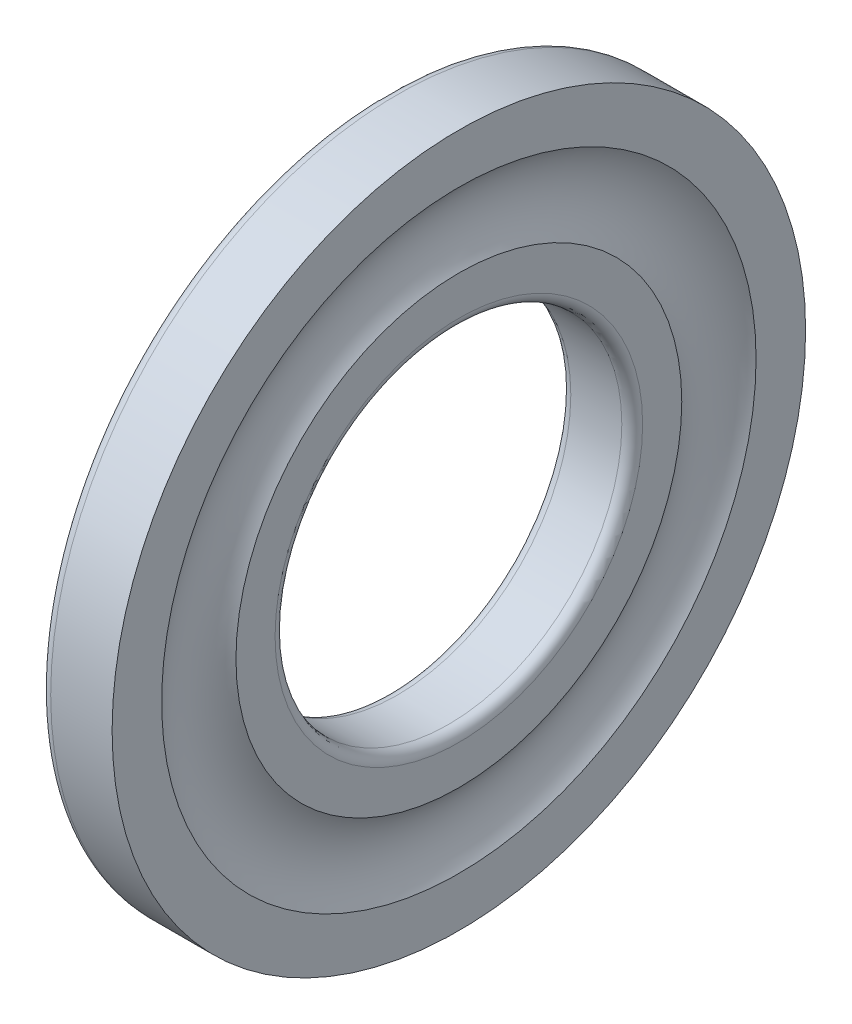
ISO-10303-21;
HEADER;
FILE_DESCRIPTION(('STEP AP214'),'2;1');
FILE_NAME('part.step','',(''),(''),'','','');
FILE_SCHEMA(('AUTOMOTIVE_DESIGN { 1 0 10303 214 1 1 1 1 }'));
ENDSEC;
DATA;
#1=APPLICATION_CONTEXT('core data for automotive mechanical design processes');
#2=APPLICATION_PROTOCOL_DEFINITION('international standard','automotive_design',2000,#1);
#3=PRODUCT_CONTEXT('',#1,'mechanical');
#4=PRODUCT('Part','Part','',(#3));
#5=PRODUCT_RELATED_PRODUCT_CATEGORY('part','',(#4));
#6=PRODUCT_DEFINITION_FORMATION('','',#4);
#7=PRODUCT_DEFINITION_CONTEXT('part definition',#1,'design');
#8=PRODUCT_DEFINITION('design','',#6,#7);
#9=PRODUCT_DEFINITION_SHAPE('','',#8);
#10=(LENGTH_UNIT() NAMED_UNIT(*) SI_UNIT(.MILLI.,.METRE.));
#11=(NAMED_UNIT(*) PLANE_ANGLE_UNIT() SI_UNIT($,.RADIAN.));
#12=(NAMED_UNIT(*) SI_UNIT($,.STERADIAN.) SOLID_ANGLE_UNIT());
#13=UNCERTAINTY_MEASURE_WITH_UNIT(LENGTH_MEASURE(1.E-05),#10,'distance_accuracy_value','');
#14=(GEOMETRIC_REPRESENTATION_CONTEXT(3) GLOBAL_UNCERTAINTY_ASSIGNED_CONTEXT((#13)) GLOBAL_UNIT_ASSIGNED_CONTEXT((#10,
#11,#12)) REPRESENTATION_CONTEXT('',''));
#15=CARTESIAN_POINT('',(0.,0.,0.));
#16=DIRECTION('',(0.,0.,1.));
#17=DIRECTION('',(1.,0.,0.));
#18=AXIS2_PLACEMENT_3D('',#15,#16,#17);
#19=CARTESIAN_POINT('',(0.599999999999877,0.,0.));
#20=DIRECTION('',(1.,0.,0.));
#21=DIRECTION('',(0.,0.,-1.));
#22=AXIS2_PLACEMENT_3D('',#19,#20,#21);
#23=TOROIDAL_SURFACE('',#22,10.5999999999999,0.599999999999877);
#24=CARTESIAN_POINT('',(0.6,0.,0.));
#25=DIRECTION('',(1.,0.,0.));
#26=DIRECTION('',(0.,0.,-1.));
#27=AXIS2_PLACEMENT_3D('',#24,#25,#26);
#28=CIRCLE('',#27,10.);
#29=CARTESIAN_POINT('',(0.6,0.,-10.));
#30=VERTEX_POINT('',#29);
#31=EDGE_CURVE('E10',#30,#30,#28,.T.);
#32=ORIENTED_EDGE('',*,*,#31,.T.);
#33=EDGE_LOOP('',(#32));
#34=FACE_BOUND('',#33,.T.);
#35=CARTESIAN_POINT('',(0.,0.,0.));
#36=DIRECTION('',(1.,0.,0.));
#37=DIRECTION('',(0.,0.,-1.));
#38=AXIS2_PLACEMENT_3D('',#35,#36,#37);
#39=CIRCLE('',#38,10.6);
#40=CARTESIAN_POINT('',(0.,0.,-10.6));
#41=VERTEX_POINT('',#40);
#42=EDGE_CURVE('E60',#41,#41,#39,.T.);
#43=ORIENTED_EDGE('',*,*,#42,.F.);
#44=EDGE_LOOP('',(#43));
#45=FACE_BOUND('',#44,.T.);
#46=ADVANCED_FACE('F29',(#34,#45),#23,.T.);
#47=CARTESIAN_POINT('',(3.542,0.,0.));
#48=DIRECTION('',(1.,0.,0.));
#49=DIRECTION('',(0.,0.,-1.));
#50=AXIS2_PLACEMENT_3D('',#47,#48,#49);
#51=CYLINDRICAL_SURFACE('',#50,10.);
#52=CARTESIAN_POINT('',(3.542,0.,0.));
#53=DIRECTION('',(1.,0.,0.));
#54=DIRECTION('',(0.,0.,-1.));
#55=AXIS2_PLACEMENT_3D('',#52,#53,#54);
#56=CIRCLE('',#55,10.);
#57=CARTESIAN_POINT('',(3.542,0.,-10.));
#58=VERTEX_POINT('',#57);
#59=EDGE_CURVE('E35',#58,#58,#56,.T.);
#60=ORIENTED_EDGE('',*,*,#59,.T.);
#61=EDGE_LOOP('',(#60));
#62=FACE_BOUND('',#61,.T.);
#63=ORIENTED_EDGE('',*,*,#31,.F.);
#64=EDGE_LOOP('',(#63));
#65=FACE_BOUND('',#64,.T.);
#66=ADVANCED_FACE('F68',(#62,#65),#51,.F.);
#67=CARTESIAN_POINT('',(3.54200000000007,0.,0.));
#68=DIRECTION('',(1.,0.,0.));
#69=DIRECTION('',(0.,0.,-1.));
#70=AXIS2_PLACEMENT_3D('',#67,#68,#69);
#71=TOROIDAL_SURFACE('',#70,10.5999999999999,0.599999999999927);
#72=CARTESIAN_POINT('',(4.142,0.,0.));
#73=DIRECTION('',(1.,0.,0.));
#74=DIRECTION('',(0.,0.,-1.));
#75=AXIS2_PLACEMENT_3D('',#72,#73,#74);
#76=CIRCLE('',#75,10.6);
#77=CARTESIAN_POINT('',(4.142,0.,-10.6));
#78=VERTEX_POINT('',#77);
#79=EDGE_CURVE('E39',#78,#78,#76,.T.);
#80=ORIENTED_EDGE('',*,*,#79,.T.);
#81=EDGE_LOOP('',(#80));
#82=FACE_BOUND('',#81,.T.);
#83=ORIENTED_EDGE('',*,*,#59,.F.);
#84=EDGE_LOOP('',(#83));
#85=FACE_BOUND('',#84,.T.);
#86=ADVANCED_FACE('F72',(#82,#85),#71,.T.);
#87=CARTESIAN_POINT('',(4.142,10.6,0.));
#88=DIRECTION('',(1.,0.,0.));
#89=DIRECTION('',(0.,0.,-1.));
#90=AXIS2_PLACEMENT_3D('',#87,#88,#89);
#91=PLANE('',#90);
#92=CARTESIAN_POINT('',(4.142,0.,0.));
#93=DIRECTION('',(1.,0.,0.));
#94=DIRECTION('',(0.,0.,-1.));
#95=AXIS2_PLACEMENT_3D('',#92,#93,#94);
#96=CIRCLE('',#95,12.857333437046);
#97=CARTESIAN_POINT('',(4.142,0.,-12.857333437046));
#98=VERTEX_POINT('',#97);
#99=EDGE_CURVE('E43',#98,#98,#96,.T.);
#100=ORIENTED_EDGE('',*,*,#99,.T.);
#101=EDGE_LOOP('',(#100));
#102=FACE_BOUND('',#101,.T.);
#103=ORIENTED_EDGE('',*,*,#79,.F.);
#104=EDGE_LOOP('',(#103));
#105=FACE_BOUND('',#104,.T.);
#106=ADVANCED_FACE('F76',(#102,#105),#91,.T.);
#107=CARTESIAN_POINT('',(7.00000000000077,0.,0.));
#108=DIRECTION('',(1.,0.,0.));
#109=DIRECTION('',(0.,0.,-1.));
#110=AXIS2_PLACEMENT_3D('',#107,#108,#109);
#111=TOROIDAL_SURFACE('',#110,15.,3.57200000000077);
#112=CARTESIAN_POINT('',(4.142,0.,0.));
#113=DIRECTION('',(1.,0.,0.));
#114=DIRECTION('',(0.,0.,-1.));
#115=AXIS2_PLACEMENT_3D('',#112,#113,#114);
#116=CIRCLE('',#115,17.142666562954);
#117=CARTESIAN_POINT('',(4.142,0.,-17.142666562954));
#118=VERTEX_POINT('',#117);
#119=EDGE_CURVE('E48',#118,#118,#116,.T.);
#120=ORIENTED_EDGE('',*,*,#119,.T.);
#121=EDGE_LOOP('',(#120));
#122=FACE_BOUND('',#121,.T.);
#123=ORIENTED_EDGE('',*,*,#99,.F.);
#124=EDGE_LOOP('',(#123));
#125=FACE_BOUND('',#124,.T.);
#126=ADVANCED_FACE('F83',(#122,#125),#111,.F.);
#127=CARTESIAN_POINT('',(4.142,17.142666562954,0.));
#128=DIRECTION('',(1.,0.,0.));
#129=DIRECTION('',(0.,0.,-1.));
#130=AXIS2_PLACEMENT_3D('',#127,#128,#129);
#131=PLANE('',#130);
#132=CARTESIAN_POINT('',(4.142,0.,0.));
#133=DIRECTION('',(1.,0.,0.));
#134=DIRECTION('',(0.,0.,-1.));
#135=AXIS2_PLACEMENT_3D('',#132,#133,#134);
#136=CIRCLE('',#135,20.);
#137=CARTESIAN_POINT('',(4.142,0.,-20.));
#138=VERTEX_POINT('',#137);
#139=EDGE_CURVE('E51',#138,#138,#136,.T.);
#140=ORIENTED_EDGE('',*,*,#139,.T.);
#141=EDGE_LOOP('',(#140));
#142=FACE_BOUND('',#141,.T.);
#143=ORIENTED_EDGE('',*,*,#119,.F.);
#144=EDGE_LOOP('',(#143));
#145=FACE_BOUND('',#144,.T.);
#146=ADVANCED_FACE('F87',(#142,#145),#131,.T.);
#147=CARTESIAN_POINT('',(3.542,0.,0.));
#148=DIRECTION('',(1.,0.,0.));
#149=DIRECTION('',(0.,0.,-1.));
#150=AXIS2_PLACEMENT_3D('',#147,#148,#149);
#151=CYLINDRICAL_SURFACE('',#150,20.);
#152=CARTESIAN_POINT('',(0.6,0.,0.));
#153=DIRECTION('',(1.,0.,0.));
#154=DIRECTION('',(0.,0.,-1.));
#155=AXIS2_PLACEMENT_3D('',#152,#153,#154);
#156=CIRCLE('',#155,20.);
#157=CARTESIAN_POINT('',(0.6,0.,-20.));
#158=VERTEX_POINT('',#157);
#159=EDGE_CURVE('E54',#158,#158,#156,.T.);
#160=ORIENTED_EDGE('',*,*,#159,.T.);
#161=EDGE_LOOP('',(#160));
#162=FACE_BOUND('',#161,.T.);
#163=ORIENTED_EDGE('',*,*,#139,.F.);
#164=EDGE_LOOP('',(#163));
#165=FACE_BOUND('',#164,.T.);
#166=ADVANCED_FACE('F91',(#162,#165),#151,.T.);
#167=CARTESIAN_POINT('',(0.599999999999877,0.,0.));
#168=DIRECTION('',(1.,0.,0.));
#169=DIRECTION('',(0.,0.,-1.));
#170=AXIS2_PLACEMENT_3D('',#167,#168,#169);
#171=TOROIDAL_SURFACE('',#170,19.4000000000001,0.599999999999876);
#172=CARTESIAN_POINT('',(0.,0.,0.));
#173=DIRECTION('',(1.,0.,0.));
#174=DIRECTION('',(0.,0.,-1.));
#175=AXIS2_PLACEMENT_3D('',#172,#173,#174);
#176=CIRCLE('',#175,19.4);
#177=CARTESIAN_POINT('',(0.,0.,-19.4));
#178=VERTEX_POINT('',#177);
#179=EDGE_CURVE('E57',#178,#178,#176,.T.);
#180=ORIENTED_EDGE('',*,*,#179,.T.);
#181=EDGE_LOOP('',(#180));
#182=FACE_BOUND('',#181,.T.);
#183=ORIENTED_EDGE('',*,*,#159,.F.);
#184=EDGE_LOOP('',(#183));
#185=FACE_BOUND('',#184,.T.);
#186=ADVANCED_FACE('F95',(#182,#185),#171,.T.);
#187=CARTESIAN_POINT('',(0.,19.4,0.));
#188=DIRECTION('',(-1.,0.,0.));
#189=DIRECTION('',(0.,0.,1.));
#190=AXIS2_PLACEMENT_3D('',#187,#188,#189);
#191=PLANE('',#190);
#192=ORIENTED_EDGE('',*,*,#42,.T.);
#193=EDGE_LOOP('',(#192));
#194=FACE_BOUND('',#193,.T.);
#195=ORIENTED_EDGE('',*,*,#179,.F.);
#196=EDGE_LOOP('',(#195));
#197=FACE_BOUND('',#196,.T.);
#198=ADVANCED_FACE('F64',(#194,#197),#191,.T.);
#199=CLOSED_SHELL('',(#46,#66,#86,#106,#126,#146,#166,#186,#198));
#200=MANIFOLD_SOLID_BREP('B2',#199);
#201=ADVANCED_BREP_SHAPE_REPRESENTATION('',(#18,#200),#14);
#202=SHAPE_DEFINITION_REPRESENTATION(#9,#201);
ENDSEC;
END-ISO-10303-21;
